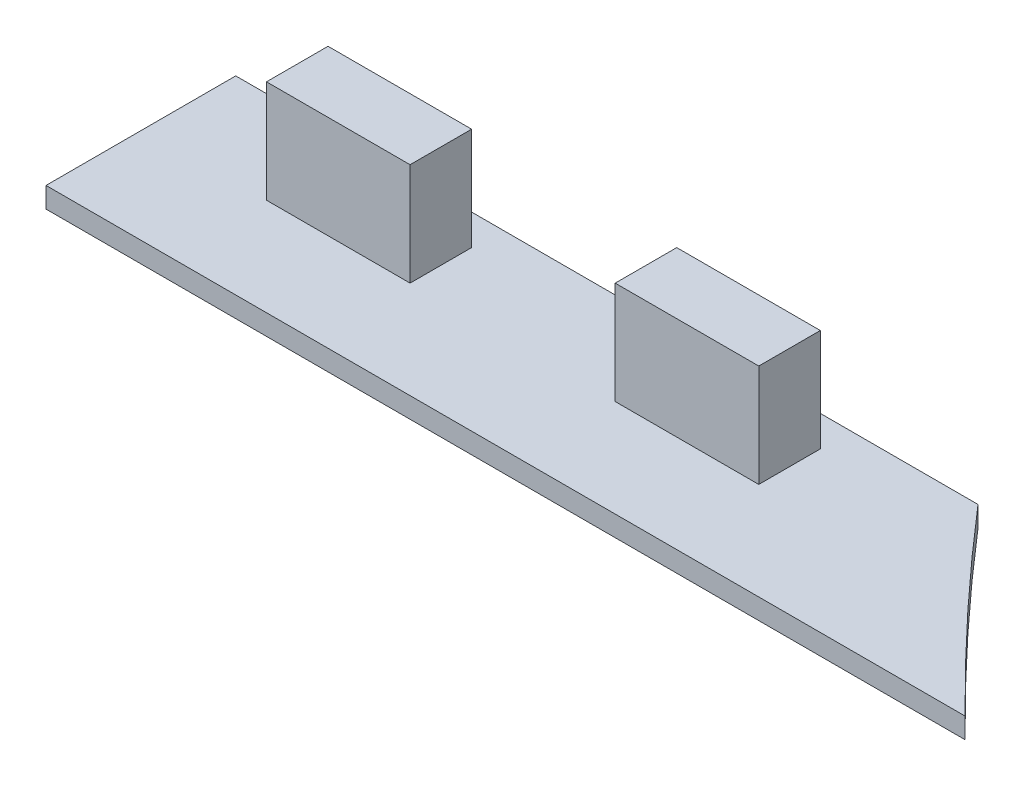
ISO-10303-21;
HEADER;
FILE_DESCRIPTION(('STEP AP214'),'2;1');
FILE_NAME('part.step','',(''),(''),'','','');
FILE_SCHEMA(('AUTOMOTIVE_DESIGN { 1 0 10303 214 1 1 1 1 }'));
ENDSEC;
DATA;
#1=APPLICATION_CONTEXT('core data for automotive mechanical design processes');
#2=APPLICATION_PROTOCOL_DEFINITION('international standard','automotive_design',2000,#1);
#3=PRODUCT_CONTEXT('',#1,'mechanical');
#4=PRODUCT('Part','Part','',(#3));
#5=PRODUCT_RELATED_PRODUCT_CATEGORY('part','',(#4));
#6=PRODUCT_DEFINITION_FORMATION('','',#4);
#7=PRODUCT_DEFINITION_CONTEXT('part definition',#1,'design');
#8=PRODUCT_DEFINITION('design','',#6,#7);
#9=PRODUCT_DEFINITION_SHAPE('','',#8);
#10=(LENGTH_UNIT() NAMED_UNIT(*) SI_UNIT(.MILLI.,.METRE.));
#11=(NAMED_UNIT(*) PLANE_ANGLE_UNIT() SI_UNIT($,.RADIAN.));
#12=(NAMED_UNIT(*) SI_UNIT($,.STERADIAN.) SOLID_ANGLE_UNIT());
#13=UNCERTAINTY_MEASURE_WITH_UNIT(LENGTH_MEASURE(1.E-05),#10,'distance_accuracy_value','');
#14=(GEOMETRIC_REPRESENTATION_CONTEXT(3) GLOBAL_UNCERTAINTY_ASSIGNED_CONTEXT((#13)) GLOBAL_UNIT_ASSIGNED_CONTEXT((#10,
#11,#12)) REPRESENTATION_CONTEXT('',''));
#15=CARTESIAN_POINT('',(0.,0.,0.));
#16=DIRECTION('',(0.,0.,1.));
#17=DIRECTION('',(1.,0.,0.));
#18=AXIS2_PLACEMENT_3D('',#15,#16,#17);
#19=CARTESIAN_POINT('',(202.59224857648,93.3157017452683,-15.231030609953));
#20=DIRECTION('',(0.,1.,0.));
#21=DIRECTION('',(0.,0.,1.));
#22=AXIS2_PLACEMENT_3D('',#19,#20,#21);
#23=PLANE('',#22);
#24=DIRECTION('',(0.,0.,-1.));
#25=VECTOR('',#24,1.);
#26=CARTESIAN_POINT('',(263.894917120642,93.3157017452683,55.9989117513526));
#27=LINE('',#26,#25);
#28=CARTESIAN_POINT('',(263.894917120642,93.3157017452683,52.9989117513526));
#29=VERTEX_POINT('',#28);
#30=CARTESIAN_POINT('',(263.894917120642,93.3157017452683,55.9989117513526));
#31=VERTEX_POINT('',#30);
#32=EDGE_CURVE('E88',#29,#31,#27,.F.);
#33=ORIENTED_EDGE('',*,*,#32,.F.);
#34=DIRECTION('',(-1.,0.,0.));
#35=VECTOR('',#34,1.);
#36=CARTESIAN_POINT('',(263.894917120642,93.3157017452683,52.9989117513526));
#37=LINE('',#36,#35);
#38=CARTESIAN_POINT('',(256.894917120642,93.3157017452683,52.9989117513526));
#39=VERTEX_POINT('',#38);
#40=EDGE_CURVE('E201',#39,#29,#37,.F.);
#41=ORIENTED_EDGE('',*,*,#40,.F.);
#42=DIRECTION('',(0.,0.,1.));
#43=VECTOR('',#42,1.);
#44=CARTESIAN_POINT('',(256.894917120642,93.3157017452683,52.9989117513526));
#45=LINE('',#44,#43);
#46=CARTESIAN_POINT('',(256.894917120642,93.3157017452683,55.9989117513526));
#47=VERTEX_POINT('',#46);
#48=EDGE_CURVE('E108',#47,#39,#45,.F.);
#49=ORIENTED_EDGE('',*,*,#48,.F.);
#50=DIRECTION('',(1.,0.,0.));
#51=VECTOR('',#50,1.);
#52=CARTESIAN_POINT('',(256.894917120642,93.3157017452683,55.9989117513526));
#53=LINE('',#52,#51);
#54=EDGE_CURVE('E100',#31,#47,#53,.F.);
#55=ORIENTED_EDGE('',*,*,#54,.F.);
#56=EDGE_LOOP('',(#33,#41,#49,#55));
#57=FACE_BOUND('',#56,.T.);
#58=ADVANCED_FACE('F17',(#57),#23,.T.);
#59=CARTESIAN_POINT('',(219.59224857648,93.3157017452683,-15.231030609953));
#60=DIRECTION('',(0.,1.,0.));
#61=DIRECTION('',(0.,0.,1.));
#62=AXIS2_PLACEMENT_3D('',#59,#60,#61);
#63=PLANE('',#62);
#64=DIRECTION('',(0.,0.,-1.));
#65=VECTOR('',#64,1.);
#66=CARTESIAN_POINT('',(280.894917120642,93.3157017452683,55.9989117513526));
#67=LINE('',#66,#65);
#68=CARTESIAN_POINT('',(280.894917120642,93.3157017452683,52.9989117513526));
#69=VERTEX_POINT('',#68);
#70=CARTESIAN_POINT('',(280.894917120642,93.3157017452683,55.9989117513526));
#71=VERTEX_POINT('',#70);
#72=EDGE_CURVE('E188',#69,#71,#67,.F.);
#73=ORIENTED_EDGE('',*,*,#72,.F.);
#74=DIRECTION('',(-1.,0.,0.));
#75=VECTOR('',#74,1.);
#76=CARTESIAN_POINT('',(280.894917120642,93.3157017452683,52.9989117513526));
#77=LINE('',#76,#75);
#78=CARTESIAN_POINT('',(273.894917120642,93.3157017452683,52.9989117513526));
#79=VERTEX_POINT('',#78);
#80=EDGE_CURVE('E193',#79,#69,#77,.F.);
#81=ORIENTED_EDGE('',*,*,#80,.F.);
#82=DIRECTION('',(0.,0.,1.));
#83=VECTOR('',#82,1.);
#84=CARTESIAN_POINT('',(273.894917120642,93.3157017452683,52.9989117513526));
#85=LINE('',#84,#83);
#86=CARTESIAN_POINT('',(273.894917120642,93.3157017452683,55.9989117513526));
#87=VERTEX_POINT('',#86);
#88=EDGE_CURVE('E195',#87,#79,#85,.F.);
#89=ORIENTED_EDGE('',*,*,#88,.F.);
#90=DIRECTION('',(1.,0.,0.));
#91=VECTOR('',#90,1.);
#92=CARTESIAN_POINT('',(273.894917120642,93.3157017452683,55.9989117513526));
#93=LINE('',#92,#91);
#94=EDGE_CURVE('E183',#71,#87,#93,.F.);
#95=ORIENTED_EDGE('',*,*,#94,.F.);
#96=EDGE_LOOP('',(#73,#81,#89,#95));
#97=FACE_BOUND('',#96,.T.);
#98=ADVANCED_FACE('F271',(#97),#63,.T.);
#99=CARTESIAN_POINT('',(263.894917120642,93.3157017452683,55.9989117513526));
#100=DIRECTION('',(1.,0.,0.));
#101=DIRECTION('',(0.,0.,-1.));
#102=AXIS2_PLACEMENT_3D('',#99,#100,#101);
#103=PLANE('',#102);
#104=DIRECTION('',(0.,0.,1.));
#105=VECTOR('',#104,1.);
#106=CARTESIAN_POINT('',(263.894917120642,88.3157017452683,38.768969390047));
#107=LINE('',#106,#105);
#108=CARTESIAN_POINT('',(263.894917120642,88.3157017452683,52.9989117513526));
#109=VERTEX_POINT('',#108);
#110=CARTESIAN_POINT('',(263.894917120642,88.3157017452683,55.9989117513526));
#111=VERTEX_POINT('',#110);
#112=EDGE_CURVE('E168',#109,#111,#107,.T.);
#113=ORIENTED_EDGE('',*,*,#112,.F.);
#114=DIRECTION('',(0.,1.,0.));
#115=VECTOR('',#114,1.);
#116=CARTESIAN_POINT('',(263.894917120642,93.3157017452683,52.9989117513526));
#117=LINE('',#116,#115);
#118=EDGE_CURVE('E96',#29,#109,#117,.F.);
#119=ORIENTED_EDGE('',*,*,#118,.F.);
#120=ORIENTED_EDGE('',*,*,#32,.T.);
#121=DIRECTION('',(0.,1.,0.));
#122=VECTOR('',#121,1.);
#123=CARTESIAN_POINT('',(263.894917120642,93.3157017452683,55.9989117513526));
#124=LINE('',#123,#122);
#125=EDGE_CURVE('E93',#111,#31,#124,.T.);
#126=ORIENTED_EDGE('',*,*,#125,.F.);
#127=EDGE_LOOP('',(#113,#119,#120,#126));
#128=FACE_BOUND('',#127,.T.);
#129=ADVANCED_FACE('F91',(#128),#103,.T.);
#130=CARTESIAN_POINT('',(256.894917120642,93.3157017452683,55.9989117513526));
#131=DIRECTION('',(0.,0.,1.));
#132=DIRECTION('',(1.,0.,0.));
#133=AXIS2_PLACEMENT_3D('',#130,#131,#132);
#134=PLANE('',#133);
#135=DIRECTION('',(1.,0.,0.));
#136=VECTOR('',#135,1.);
#137=CARTESIAN_POINT('',(627.09224857648,88.3157017452683,55.9989117513526));
#138=LINE('',#137,#136);
#139=CARTESIAN_POINT('',(256.894917120642,88.3157017452683,55.9989117513526));
#140=VERTEX_POINT('',#139);
#141=EDGE_CURVE('E107',#111,#140,#138,.F.);
#142=ORIENTED_EDGE('',*,*,#141,.F.);
#143=ORIENTED_EDGE('',*,*,#125,.T.);
#144=ORIENTED_EDGE('',*,*,#54,.T.);
#145=DIRECTION('',(0.,1.,0.));
#146=VECTOR('',#145,1.);
#147=CARTESIAN_POINT('',(256.894917120642,93.3157017452683,55.9989117513526));
#148=LINE('',#147,#146);
#149=EDGE_CURVE('E203',#140,#47,#148,.T.);
#150=ORIENTED_EDGE('',*,*,#149,.F.);
#151=EDGE_LOOP('',(#142,#143,#144,#150));
#152=FACE_BOUND('',#151,.T.);
#153=ADVANCED_FACE('F103',(#152),#134,.T.);
#154=CARTESIAN_POINT('',(256.894917120642,93.3157017452683,52.9989117513526));
#155=DIRECTION('',(-1.,0.,0.));
#156=DIRECTION('',(0.,0.,1.));
#157=AXIS2_PLACEMENT_3D('',#154,#155,#156);
#158=PLANE('',#157);
#159=DIRECTION('',(0.,0.,1.));
#160=VECTOR('',#159,1.);
#161=CARTESIAN_POINT('',(256.894917120642,88.3157017452683,38.768969390047));
#162=LINE('',#161,#160);
#163=CARTESIAN_POINT('',(256.894917120642,88.3157017452683,52.9989117513526));
#164=VERTEX_POINT('',#163);
#165=EDGE_CURVE('E164',#140,#164,#162,.F.);
#166=ORIENTED_EDGE('',*,*,#165,.F.);
#167=ORIENTED_EDGE('',*,*,#149,.T.);
#168=ORIENTED_EDGE('',*,*,#48,.T.);
#169=DIRECTION('',(0.,1.,0.));
#170=VECTOR('',#169,1.);
#171=CARTESIAN_POINT('',(256.894917120642,93.3157017452683,52.9989117513526));
#172=LINE('',#171,#170);
#173=EDGE_CURVE('E197',#164,#39,#172,.T.);
#174=ORIENTED_EDGE('',*,*,#173,.F.);
#175=EDGE_LOOP('',(#166,#167,#168,#174));
#176=FACE_BOUND('',#175,.T.);
#177=ADVANCED_FACE('F207',(#176),#158,.T.);
#178=CARTESIAN_POINT('',(263.894917120642,93.3157017452683,52.9989117513526));
#179=DIRECTION('',(0.,0.,-1.));
#180=DIRECTION('',(-1.,0.,0.));
#181=AXIS2_PLACEMENT_3D('',#178,#179,#180);
#182=PLANE('',#181);
#183=DIRECTION('',(1.,0.,0.));
#184=VECTOR('',#183,1.);
#185=CARTESIAN_POINT('',(627.09224857648,88.3157017452683,52.9989117513526));
#186=LINE('',#185,#184);
#187=EDGE_CURVE('E161',#164,#109,#186,.T.);
#188=ORIENTED_EDGE('',*,*,#187,.F.);
#189=ORIENTED_EDGE('',*,*,#173,.T.);
#190=ORIENTED_EDGE('',*,*,#40,.T.);
#191=ORIENTED_EDGE('',*,*,#118,.T.);
#192=EDGE_LOOP('',(#188,#189,#190,#191));
#193=FACE_BOUND('',#192,.T.);
#194=ADVANCED_FACE('F211',(#193),#182,.T.);
#195=CARTESIAN_POINT('',(273.894917120642,93.3157017452683,52.9989117513526));
#196=DIRECTION('',(-1.,0.,0.));
#197=DIRECTION('',(0.,0.,1.));
#198=AXIS2_PLACEMENT_3D('',#195,#196,#197);
#199=PLANE('',#198);
#200=DIRECTION('',(0.,0.,1.));
#201=VECTOR('',#200,1.);
#202=CARTESIAN_POINT('',(273.894917120642,88.3157017452683,38.768969390047));
#203=LINE('',#202,#201);
#204=CARTESIAN_POINT('',(273.894917120642,88.3157017452683,55.9989117513526));
#205=VERTEX_POINT('',#204);
#206=CARTESIAN_POINT('',(273.894917120642,88.3157017452683,52.9989117513526));
#207=VERTEX_POINT('',#206);
#208=EDGE_CURVE('E158',#205,#207,#203,.F.);
#209=ORIENTED_EDGE('',*,*,#208,.F.);
#210=DIRECTION('',(0.,1.,0.));
#211=VECTOR('',#210,1.);
#212=CARTESIAN_POINT('',(273.894917120642,93.3157017452683,55.9989117513526));
#213=LINE('',#212,#211);
#214=EDGE_CURVE('E180',#87,#205,#213,.F.);
#215=ORIENTED_EDGE('',*,*,#214,.F.);
#216=ORIENTED_EDGE('',*,*,#88,.T.);
#217=DIRECTION('',(0.,1.,0.));
#218=VECTOR('',#217,1.);
#219=CARTESIAN_POINT('',(273.894917120642,93.3157017452683,52.9989117513526));
#220=LINE('',#219,#218);
#221=EDGE_CURVE('E190',#207,#79,#220,.T.);
#222=ORIENTED_EDGE('',*,*,#221,.F.);
#223=EDGE_LOOP('',(#209,#215,#216,#222));
#224=FACE_BOUND('',#223,.T.);
#225=ADVANCED_FACE('F259',(#224),#199,.T.);
#226=CARTESIAN_POINT('',(280.894917120642,93.3157017452683,52.9989117513526));
#227=DIRECTION('',(0.,0.,-1.));
#228=DIRECTION('',(-1.,0.,0.));
#229=AXIS2_PLACEMENT_3D('',#226,#227,#228);
#230=PLANE('',#229);
#231=DIRECTION('',(1.,0.,0.));
#232=VECTOR('',#231,1.);
#233=CARTESIAN_POINT('',(627.09224857648,88.3157017452683,52.9989117513526));
#234=LINE('',#233,#232);
#235=CARTESIAN_POINT('',(280.894917120642,88.3157017452683,52.9989117513526));
#236=VERTEX_POINT('',#235);
#237=EDGE_CURVE('E155',#207,#236,#234,.T.);
#238=ORIENTED_EDGE('',*,*,#237,.F.);
#239=ORIENTED_EDGE('',*,*,#221,.T.);
#240=ORIENTED_EDGE('',*,*,#80,.T.);
#241=DIRECTION('',(0.,1.,0.));
#242=VECTOR('',#241,1.);
#243=CARTESIAN_POINT('',(280.894917120642,93.3157017452683,52.9989117513526));
#244=LINE('',#243,#242);
#245=EDGE_CURVE('E185',#236,#69,#244,.T.);
#246=ORIENTED_EDGE('',*,*,#245,.F.);
#247=EDGE_LOOP('',(#238,#239,#240,#246));
#248=FACE_BOUND('',#247,.T.);
#249=ADVANCED_FACE('F255',(#248),#230,.T.);
#250=CARTESIAN_POINT('',(280.894917120642,93.3157017452683,55.9989117513526));
#251=DIRECTION('',(1.,0.,0.));
#252=DIRECTION('',(0.,0.,-1.));
#253=AXIS2_PLACEMENT_3D('',#250,#251,#252);
#254=PLANE('',#253);
#255=DIRECTION('',(0.,0.,1.));
#256=VECTOR('',#255,1.);
#257=CARTESIAN_POINT('',(280.894917120642,88.3157017452683,38.768969390047));
#258=LINE('',#257,#256);
#259=CARTESIAN_POINT('',(280.894917120642,88.3157017452683,55.9989117513526));
#260=VERTEX_POINT('',#259);
#261=EDGE_CURVE('E153',#236,#260,#258,.T.);
#262=ORIENTED_EDGE('',*,*,#261,.F.);
#263=ORIENTED_EDGE('',*,*,#245,.T.);
#264=ORIENTED_EDGE('',*,*,#72,.T.);
#265=DIRECTION('',(0.,1.,0.));
#266=VECTOR('',#265,1.);
#267=CARTESIAN_POINT('',(280.894917120642,93.3157017452683,55.9989117513526));
#268=LINE('',#267,#266);
#269=EDGE_CURVE('E171',#260,#71,#268,.T.);
#270=ORIENTED_EDGE('',*,*,#269,.F.);
#271=EDGE_LOOP('',(#262,#263,#264,#270));
#272=FACE_BOUND('',#271,.T.);
#273=ADVANCED_FACE('F251',(#272),#254,.T.);
#274=CARTESIAN_POINT('',(273.894917120642,93.3157017452683,55.9989117513526));
#275=DIRECTION('',(0.,0.,1.));
#276=DIRECTION('',(1.,0.,0.));
#277=AXIS2_PLACEMENT_3D('',#274,#275,#276);
#278=PLANE('',#277);
#279=DIRECTION('',(1.,0.,0.));
#280=VECTOR('',#279,1.);
#281=CARTESIAN_POINT('',(627.09224857648,88.3157017452683,55.9989117513526));
#282=LINE('',#281,#280);
#283=EDGE_CURVE('E150',#260,#205,#282,.F.);
#284=ORIENTED_EDGE('',*,*,#283,.F.);
#285=ORIENTED_EDGE('',*,*,#269,.T.);
#286=ORIENTED_EDGE('',*,*,#94,.T.);
#287=ORIENTED_EDGE('',*,*,#214,.T.);
#288=EDGE_LOOP('',(#284,#285,#286,#287));
#289=FACE_BOUND('',#288,.T.);
#290=ADVANCED_FACE('F247',(#289),#278,.T.);
#291=CARTESIAN_POINT('',(627.09224857648,88.3157017452683,38.768969390047));
#292=DIRECTION('',(0.,1.,0.));
#293=DIRECTION('',(0.,0.,1.));
#294=AXIS2_PLACEMENT_3D('',#291,#292,#293);
#295=PLANE('',#294);
#296=ORIENTED_EDGE('',*,*,#261,.T.);
#297=ORIENTED_EDGE('',*,*,#283,.T.);
#298=ORIENTED_EDGE('',*,*,#208,.T.);
#299=ORIENTED_EDGE('',*,*,#237,.T.);
#300=EDGE_LOOP('',(#296,#297,#298,#299));
#301=FACE_BOUND('',#300,.T.);
#302=ORIENTED_EDGE('',*,*,#165,.T.);
#303=ORIENTED_EDGE('',*,*,#187,.T.);
#304=ORIENTED_EDGE('',*,*,#112,.T.);
#305=ORIENTED_EDGE('',*,*,#141,.T.);
#306=EDGE_LOOP('',(#302,#303,#304,#305));
#307=FACE_BOUND('',#306,.T.);
#308=CARTESIAN_POINT('',(406.894917120642,88.3157017452683,-51.5010882486474));
#309=DIRECTION('',(0.,1.,0.));
#310=DIRECTION('',(0.,0.,1.));
#311=AXIS2_PLACEMENT_3D('',#308,#309,#310);
#312=CIRCLE('',#311,158.);
#313=CARTESIAN_POINT('',(295.701673171201,88.3157017452683,60.7489117513527));
#314=VERTEX_POINT('',#313);
#315=CARTESIAN_POINT('',(287.082563834347,88.3157017452683,51.4989117513526));
#316=VERTEX_POINT('',#315);
#317=EDGE_CURVE('E20',#314,#316,#312,.F.);
#318=ORIENTED_EDGE('',*,*,#317,.T.);
#319=DIRECTION('',(-1.,0.,0.));
#320=VECTOR('',#319,1.);
#321=CARTESIAN_POINT('',(250.894917120642,88.3157017452683,51.4989117513526));
#322=LINE('',#321,#320);
#323=CARTESIAN_POINT('',(250.894917120642,88.3157017452683,51.4989117513526));
#324=VERTEX_POINT('',#323);
#325=EDGE_CURVE('E131',#324,#316,#322,.F.);
#326=ORIENTED_EDGE('',*,*,#325,.F.);
#327=DIRECTION('',(0.,0.,1.));
#328=VECTOR('',#327,1.);
#329=CARTESIAN_POINT('',(250.894917120642,88.3157017452683,111.498911751353));
#330=LINE('',#329,#328);
#331=CARTESIAN_POINT('',(250.894917120642,88.3157017452683,60.7489117513526));
#332=VERTEX_POINT('',#331);
#333=EDGE_CURVE('E54',#332,#324,#330,.F.);
#334=ORIENTED_EDGE('',*,*,#333,.F.);
#335=DIRECTION('',(-1.,0.,0.));
#336=VECTOR('',#335,1.);
#337=CARTESIAN_POINT('',(234.762444,88.3157017452683,60.7489117513526));
#338=LINE('',#337,#336);
#339=EDGE_CURVE('E144',#332,#314,#338,.F.);
#340=ORIENTED_EDGE('',*,*,#339,.T.);
#341=EDGE_LOOP('',(#318,#326,#334,#340));
#342=FACE_BOUND('',#341,.T.);
#343=ADVANCED_FACE('F216',(#301,#307,#342),#295,.T.);
#344=CARTESIAN_POINT('',(250.894917120642,87.3157017452683,111.498911751353));
#345=DIRECTION('',(-1.,0.,0.));
#346=DIRECTION('',(0.,0.,1.));
#347=AXIS2_PLACEMENT_3D('',#344,#345,#346);
#348=PLANE('',#347);
#349=ORIENTED_EDGE('',*,*,#333,.T.);
#350=DIRECTION('',(0.,1.,0.));
#351=VECTOR('',#350,1.);
#352=CARTESIAN_POINT('',(250.894917120642,87.3157017452683,51.4989117513526));
#353=LINE('',#352,#351);
#354=CARTESIAN_POINT('',(250.894917120642,87.3157017452683,51.4989117513526));
#355=VERTEX_POINT('',#354);
#356=EDGE_CURVE('E132',#355,#324,#353,.T.);
#357=ORIENTED_EDGE('',*,*,#356,.F.);
#358=DIRECTION('',(0.,0.,1.));
#359=VECTOR('',#358,1.);
#360=CARTESIAN_POINT('',(250.894917120642,87.3157017452683,38.768969390047));
#361=LINE('',#360,#359);
#362=CARTESIAN_POINT('',(250.894917120642,87.3157017452683,60.7489117513526));
#363=VERTEX_POINT('',#362);
#364=EDGE_CURVE('E117',#355,#363,#361,.T.);
#365=ORIENTED_EDGE('',*,*,#364,.T.);
#366=DIRECTION('',(0.,1.,0.));
#367=VECTOR('',#366,1.);
#368=CARTESIAN_POINT('',(250.894917120642,86.7156777452683,60.7489117513526));
#369=LINE('',#368,#367);
#370=EDGE_CURVE('E141',#363,#332,#369,.T.);
#371=ORIENTED_EDGE('',*,*,#370,.T.);
#372=EDGE_LOOP('',(#349,#357,#365,#371));
#373=FACE_BOUND('',#372,.T.);
#374=ADVANCED_FACE('F228',(#373),#348,.T.);
#375=CARTESIAN_POINT('',(234.762444,86.7156777452683,60.7489117513526));
#376=DIRECTION('',(0.,0.,-1.));
#377=DIRECTION('',(-1.,0.,0.));
#378=AXIS2_PLACEMENT_3D('',#375,#376,#377);
#379=PLANE('',#378);
#380=ORIENTED_EDGE('',*,*,#339,.F.);
#381=ORIENTED_EDGE('',*,*,#370,.F.);
#382=DIRECTION('',(1.,0.,0.));
#383=VECTOR('',#382,1.);
#384=CARTESIAN_POINT('',(627.09224857648,87.3157017452683,60.7489117513526));
#385=LINE('',#384,#383);
#386=CARTESIAN_POINT('',(295.701673171201,87.3157017452683,60.7489117513527));
#387=VERTEX_POINT('',#386);
#388=EDGE_CURVE('E114',#363,#387,#385,.T.);
#389=ORIENTED_EDGE('',*,*,#388,.T.);
#390=DIRECTION('',(0.,1.,0.));
#391=VECTOR('',#390,1.);
#392=CARTESIAN_POINT('',(295.701673171201,87.3157017452683,60.7489117513528));
#393=LINE('',#392,#391);
#394=EDGE_CURVE('E135',#387,#314,#393,.T.);
#395=ORIENTED_EDGE('',*,*,#394,.T.);
#396=EDGE_LOOP('',(#380,#381,#389,#395));
#397=FACE_BOUND('',#396,.T.);
#398=ADVANCED_FACE('F223',(#397),#379,.F.);
#399=CARTESIAN_POINT('',(406.894917120642,87.3157017452683,-51.5010882486474));
#400=DIRECTION('',(0.,1.,0.));
#401=DIRECTION('',(0.,0.,1.));
#402=AXIS2_PLACEMENT_3D('',#399,#400,#401);
#403=CYLINDRICAL_SURFACE('',#402,158.);
#404=CARTESIAN_POINT('',(406.894917120642,87.3157017452683,-51.5010882486474));
#405=DIRECTION('',(0.,1.,0.));
#406=DIRECTION('',(0.,0.,1.));
#407=AXIS2_PLACEMENT_3D('',#404,#405,#406);
#408=CIRCLE('',#407,158.);
#409=CARTESIAN_POINT('',(287.082563834347,87.3157017452683,51.4989117513526));
#410=VERTEX_POINT('',#409);
#411=EDGE_CURVE('E26',#387,#410,#408,.F.);
#412=ORIENTED_EDGE('',*,*,#411,.T.);
#413=DIRECTION('',(0.,1.,0.));
#414=VECTOR('',#413,1.);
#415=CARTESIAN_POINT('',(287.082563834347,87.3157017452683,51.4989117513526));
#416=LINE('',#415,#414);
#417=EDGE_CURVE('E34',#316,#410,#416,.F.);
#418=ORIENTED_EDGE('',*,*,#417,.F.);
#419=ORIENTED_EDGE('',*,*,#317,.F.);
#420=ORIENTED_EDGE('',*,*,#394,.F.);
#421=EDGE_LOOP('',(#412,#418,#419,#420));
#422=FACE_BOUND('',#421,.T.);
#423=ADVANCED_FACE('F231',(#422),#403,.F.);
#424=CARTESIAN_POINT('',(250.894917120642,87.3157017452683,51.4989117513526));
#425=DIRECTION('',(0.,0.,-1.));
#426=DIRECTION('',(-1.,0.,0.));
#427=AXIS2_PLACEMENT_3D('',#424,#425,#426);
#428=PLANE('',#427);
#429=ORIENTED_EDGE('',*,*,#325,.T.);
#430=ORIENTED_EDGE('',*,*,#417,.T.);
#431=DIRECTION('',(1.,0.,0.));
#432=VECTOR('',#431,1.);
#433=CARTESIAN_POINT('',(627.09224857648,87.3157017452683,51.4989117513526));
#434=LINE('',#433,#432);
#435=EDGE_CURVE('E11',#410,#355,#434,.F.);
#436=ORIENTED_EDGE('',*,*,#435,.T.);
#437=ORIENTED_EDGE('',*,*,#356,.T.);
#438=EDGE_LOOP('',(#429,#430,#436,#437));
#439=FACE_BOUND('',#438,.T.);
#440=ADVANCED_FACE('F229',(#439),#428,.T.);
#441=CARTESIAN_POINT('',(627.09224857648,87.3157017452683,38.768969390047));
#442=DIRECTION('',(0.,1.,0.));
#443=DIRECTION('',(0.,0.,1.));
#444=AXIS2_PLACEMENT_3D('',#441,#442,#443);
#445=PLANE('',#444);
#446=ORIENTED_EDGE('',*,*,#411,.F.);
#447=ORIENTED_EDGE('',*,*,#388,.F.);
#448=ORIENTED_EDGE('',*,*,#364,.F.);
#449=ORIENTED_EDGE('',*,*,#435,.F.);
#450=EDGE_LOOP('',(#446,#447,#448,#449));
#451=FACE_BOUND('',#450,.T.);
#452=ADVANCED_FACE('F226',(#451),#445,.F.);
#453=CLOSED_SHELL('',(#58,#98,#129,#153,#177,#194,#225,#249,#273,#290,#343,#374,#398,#423,#440,#452));
#454=MANIFOLD_SOLID_BREP('B1',#453);
#455=ADVANCED_BREP_SHAPE_REPRESENTATION('',(#18,#454),#14);
#456=SHAPE_DEFINITION_REPRESENTATION(#9,#455);
ENDSEC;
END-ISO-10303-21;
